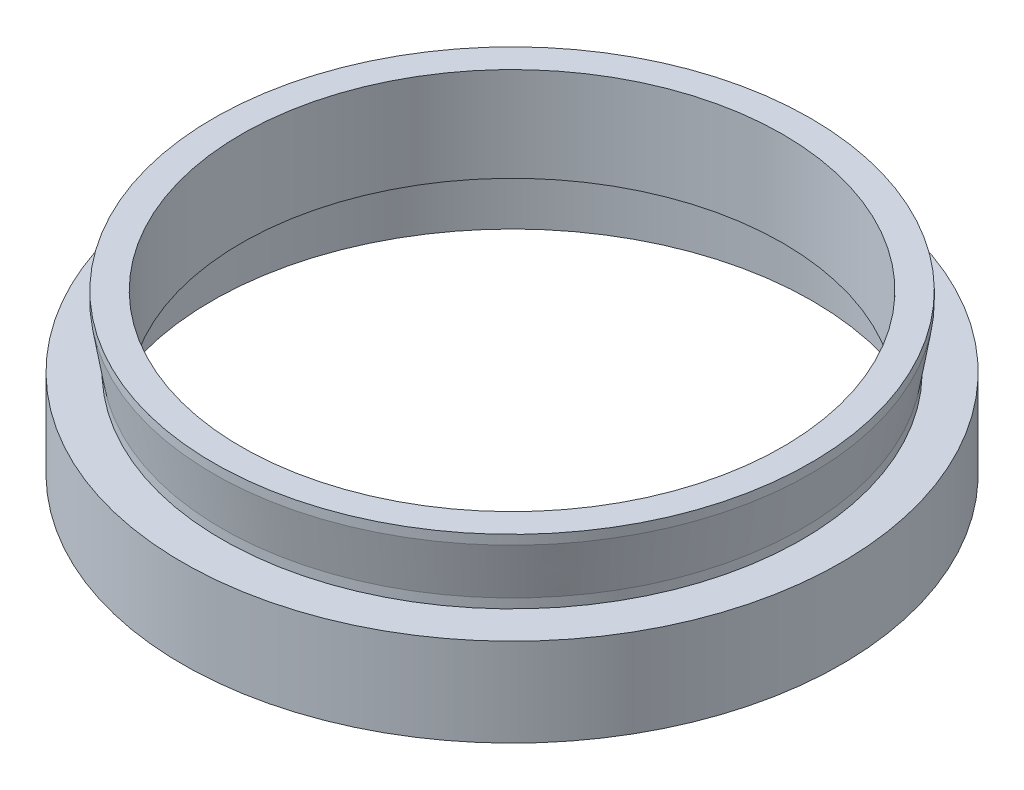
ISO-10303-21;
HEADER;
FILE_DESCRIPTION(('STEP AP214'),'2;1');
FILE_NAME('part.step','',(''),(''),'','','');
FILE_SCHEMA(('AUTOMOTIVE_DESIGN { 1 0 10303 214 1 1 1 1 }'));
ENDSEC;
DATA;
#1=APPLICATION_CONTEXT('core data for automotive mechanical design processes');
#2=APPLICATION_PROTOCOL_DEFINITION('international standard','automotive_design',2000,#1);
#3=PRODUCT_CONTEXT('',#1,'mechanical');
#4=PRODUCT('Part','Part','',(#3));
#5=PRODUCT_RELATED_PRODUCT_CATEGORY('part','',(#4));
#6=PRODUCT_DEFINITION_FORMATION('','',#4);
#7=PRODUCT_DEFINITION_CONTEXT('part definition',#1,'design');
#8=PRODUCT_DEFINITION('design','',#6,#7);
#9=PRODUCT_DEFINITION_SHAPE('','',#8);
#10=(LENGTH_UNIT() NAMED_UNIT(*) SI_UNIT(.MILLI.,.METRE.));
#11=(NAMED_UNIT(*) PLANE_ANGLE_UNIT() SI_UNIT($,.RADIAN.));
#12=(NAMED_UNIT(*) SI_UNIT($,.STERADIAN.) SOLID_ANGLE_UNIT());
#13=UNCERTAINTY_MEASURE_WITH_UNIT(LENGTH_MEASURE(1.E-05),#10,'distance_accuracy_value','');
#14=(GEOMETRIC_REPRESENTATION_CONTEXT(3) GLOBAL_UNCERTAINTY_ASSIGNED_CONTEXT((#13)) GLOBAL_UNIT_ASSIGNED_CONTEXT((#10,
#11,#12)) REPRESENTATION_CONTEXT('',''));
#15=CARTESIAN_POINT('',(0.,0.,0.));
#16=DIRECTION('',(0.,0.,1.));
#17=DIRECTION('',(1.,0.,0.));
#18=AXIS2_PLACEMENT_3D('',#15,#16,#17);
#19=CARTESIAN_POINT('',(-23.,13.,0.));
#20=DIRECTION('',(0.,-1.,0.));
#21=DIRECTION('',(0.,0.,-1.));
#22=AXIS2_PLACEMENT_3D('',#19,#20,#21);
#23=PLANE('',#22);
#24=CARTESIAN_POINT('',(0.,13.,0.));
#25=DIRECTION('',(0.,-1.,0.));
#26=DIRECTION('',(0.,0.,-1.));
#27=AXIS2_PLACEMENT_3D('',#24,#25,#26);
#28=CIRCLE('',#27,25.365);
#29=CARTESIAN_POINT('',(0.,13.,-25.365));
#30=VERTEX_POINT('',#29);
#31=EDGE_CURVE('E10',#30,#30,#28,.T.);
#32=ORIENTED_EDGE('',*,*,#31,.F.);
#33=EDGE_LOOP('',(#32));
#34=FACE_BOUND('',#33,.T.);
#35=CARTESIAN_POINT('',(0.,13.,0.));
#36=DIRECTION('',(0.,-1.,0.));
#37=DIRECTION('',(0.,0.,-1.));
#38=AXIS2_PLACEMENT_3D('',#35,#36,#37);
#39=CIRCLE('',#38,23.);
#40=CARTESIAN_POINT('',(0.,13.,-23.));
#41=VERTEX_POINT('',#40);
#42=EDGE_CURVE('E75',#41,#41,#39,.T.);
#43=ORIENTED_EDGE('',*,*,#42,.T.);
#44=EDGE_LOOP('',(#43));
#45=FACE_BOUND('',#44,.T.);
#46=ADVANCED_FACE('F35',(#34,#45),#23,.F.);
#47=CARTESIAN_POINT('',(0.,0.,0.));
#48=DIRECTION('',(0.,-1.,0.));
#49=DIRECTION('',(0.,0.,-1.));
#50=AXIS2_PLACEMENT_3D('',#47,#48,#49);
#51=CYLINDRICAL_SURFACE('',#50,25.365);
#52=CARTESIAN_POINT('',(0.,12.2,0.));
#53=DIRECTION('',(0.,-1.,0.));
#54=DIRECTION('',(0.,0.,-1.));
#55=AXIS2_PLACEMENT_3D('',#52,#53,#54);
#56=CIRCLE('',#55,25.365);
#57=CARTESIAN_POINT('',(0.,12.2,-25.365));
#58=VERTEX_POINT('',#57);
#59=EDGE_CURVE('E41',#58,#58,#56,.T.);
#60=ORIENTED_EDGE('',*,*,#59,.F.);
#61=EDGE_LOOP('',(#60));
#62=FACE_BOUND('',#61,.T.);
#63=ORIENTED_EDGE('',*,*,#31,.T.);
#64=EDGE_LOOP('',(#63));
#65=FACE_BOUND('',#64,.T.);
#66=ADVANCED_FACE('F136',(#62,#65),#51,.T.);
#67=CARTESIAN_POINT('',(0.,12.2,0.));
#68=DIRECTION('',(0.,1.,0.));
#69=DIRECTION('',(0.,0.,1.));
#70=AXIS2_PLACEMENT_3D('',#67,#68,#69);
#71=CONICAL_SURFACE('',#70,25.365,0.164411486247027);
#72=CARTESIAN_POINT('',(0.,7.8,0.));
#73=DIRECTION('',(0.,-1.,0.));
#74=DIRECTION('',(0.,0.,-1.));
#75=AXIS2_PLACEMENT_3D('',#72,#73,#74);
#76=CIRCLE('',#75,24.635);
#77=CARTESIAN_POINT('',(0.,7.8,-24.635));
#78=VERTEX_POINT('',#77);
#79=EDGE_CURVE('E45',#78,#78,#76,.T.);
#80=ORIENTED_EDGE('',*,*,#79,.F.);
#81=EDGE_LOOP('',(#80));
#82=FACE_BOUND('',#81,.T.);
#83=ORIENTED_EDGE('',*,*,#59,.T.);
#84=EDGE_LOOP('',(#83));
#85=FACE_BOUND('',#84,.T.);
#86=ADVANCED_FACE('F131',(#82,#85),#71,.T.);
#87=CARTESIAN_POINT('',(0.,0.,0.));
#88=DIRECTION('',(0.,-1.,0.));
#89=DIRECTION('',(0.,0.,-1.));
#90=AXIS2_PLACEMENT_3D('',#87,#88,#89);
#91=CYLINDRICAL_SURFACE('',#90,24.635);
#92=CARTESIAN_POINT('',(0.,7.,0.));
#93=DIRECTION('',(0.,-1.,0.));
#94=DIRECTION('',(0.,0.,-1.));
#95=AXIS2_PLACEMENT_3D('',#92,#93,#94);
#96=CIRCLE('',#95,24.635);
#97=CARTESIAN_POINT('',(0.,7.,-24.635));
#98=VERTEX_POINT('',#97);
#99=EDGE_CURVE('E49',#98,#98,#96,.T.);
#100=ORIENTED_EDGE('',*,*,#99,.F.);
#101=EDGE_LOOP('',(#100));
#102=FACE_BOUND('',#101,.T.);
#103=ORIENTED_EDGE('',*,*,#79,.T.);
#104=EDGE_LOOP('',(#103));
#105=FACE_BOUND('',#104,.T.);
#106=ADVANCED_FACE('F125',(#102,#105),#91,.T.);
#107=CARTESIAN_POINT('',(-24.635,7.,0.));
#108=DIRECTION('',(0.,-1.,0.));
#109=DIRECTION('',(0.,0.,-1.));
#110=AXIS2_PLACEMENT_3D('',#107,#108,#109);
#111=PLANE('',#110);
#112=CARTESIAN_POINT('',(0.,7.,0.));
#113=DIRECTION('',(0.,-1.,0.));
#114=DIRECTION('',(0.,0.,-1.));
#115=AXIS2_PLACEMENT_3D('',#112,#113,#114);
#116=CIRCLE('',#115,28.);
#117=CARTESIAN_POINT('',(0.,7.,-28.));
#118=VERTEX_POINT('',#117);
#119=EDGE_CURVE('E54',#118,#118,#116,.T.);
#120=ORIENTED_EDGE('',*,*,#119,.F.);
#121=EDGE_LOOP('',(#120));
#122=FACE_BOUND('',#121,.T.);
#123=ORIENTED_EDGE('',*,*,#99,.T.);
#124=EDGE_LOOP('',(#123));
#125=FACE_BOUND('',#124,.T.);
#126=ADVANCED_FACE('F119',(#122,#125),#111,.F.);
#127=CARTESIAN_POINT('',(0.,0.,0.));
#128=DIRECTION('',(0.,-1.,0.));
#129=DIRECTION('',(0.,0.,-1.));
#130=AXIS2_PLACEMENT_3D('',#127,#128,#129);
#131=CYLINDRICAL_SURFACE('',#130,28.);
#132=CARTESIAN_POINT('',(0.,-0.500000000000002,0.));
#133=DIRECTION('',(0.,-1.,0.));
#134=DIRECTION('',(0.,0.,-1.));
#135=AXIS2_PLACEMENT_3D('',#132,#133,#134);
#136=CIRCLE('',#135,28.);
#137=CARTESIAN_POINT('',(0.,-0.500000000000002,-28.));
#138=VERTEX_POINT('',#137);
#139=EDGE_CURVE('E57',#138,#138,#136,.T.);
#140=ORIENTED_EDGE('',*,*,#139,.F.);
#141=EDGE_LOOP('',(#140));
#142=FACE_BOUND('',#141,.T.);
#143=ORIENTED_EDGE('',*,*,#119,.T.);
#144=EDGE_LOOP('',(#143));
#145=FACE_BOUND('',#144,.T.);
#146=ADVANCED_FACE('F113',(#142,#145),#131,.T.);
#147=CARTESIAN_POINT('',(-28.,-0.500000000000002,0.));
#148=DIRECTION('',(0.,1.,0.));
#149=DIRECTION('',(0.,0.,1.));
#150=AXIS2_PLACEMENT_3D('',#147,#148,#149);
#151=PLANE('',#150);
#152=CARTESIAN_POINT('',(0.,-0.500000000000002,0.));
#153=DIRECTION('',(0.,-1.,0.));
#154=DIRECTION('',(0.,0.,-1.));
#155=AXIS2_PLACEMENT_3D('',#152,#153,#154);
#156=CIRCLE('',#155,25.5);
#157=CARTESIAN_POINT('',(0.,-0.500000000000002,-25.5));
#158=VERTEX_POINT('',#157);
#159=EDGE_CURVE('E60',#158,#158,#156,.T.);
#160=ORIENTED_EDGE('',*,*,#159,.F.);
#161=EDGE_LOOP('',(#160));
#162=FACE_BOUND('',#161,.T.);
#163=ORIENTED_EDGE('',*,*,#139,.T.);
#164=EDGE_LOOP('',(#163));
#165=FACE_BOUND('',#164,.T.);
#166=ADVANCED_FACE('F107',(#162,#165),#151,.F.);
#167=CARTESIAN_POINT('',(0.,0.,0.));
#168=DIRECTION('',(0.,-1.,0.));
#169=DIRECTION('',(0.,0.,-1.));
#170=AXIS2_PLACEMENT_3D('',#167,#168,#169);
#171=CYLINDRICAL_SURFACE('',#170,25.5);
#172=CARTESIAN_POINT('',(0.,4.,0.));
#173=DIRECTION('',(0.,-1.,0.));
#174=DIRECTION('',(0.,0.,-1.));
#175=AXIS2_PLACEMENT_3D('',#172,#173,#174);
#176=CIRCLE('',#175,25.5);
#177=CARTESIAN_POINT('',(0.,4.,-25.5));
#178=VERTEX_POINT('',#177);
#179=EDGE_CURVE('E63',#178,#178,#176,.T.);
#180=ORIENTED_EDGE('',*,*,#179,.F.);
#181=EDGE_LOOP('',(#180));
#182=FACE_BOUND('',#181,.T.);
#183=ORIENTED_EDGE('',*,*,#159,.T.);
#184=EDGE_LOOP('',(#183));
#185=FACE_BOUND('',#184,.T.);
#186=ADVANCED_FACE('F101',(#182,#185),#171,.F.);
#187=CARTESIAN_POINT('',(-26.5,4.,0.));
#188=DIRECTION('',(0.,-1.,0.));
#189=DIRECTION('',(0.,0.,-1.));
#190=AXIS2_PLACEMENT_3D('',#187,#188,#189);
#191=PLANE('',#190);
#192=CARTESIAN_POINT('',(0.,4.,0.));
#193=DIRECTION('',(0.,-1.,0.));
#194=DIRECTION('',(0.,0.,-1.));
#195=AXIS2_PLACEMENT_3D('',#192,#193,#194);
#196=CIRCLE('',#195,26.5);
#197=CARTESIAN_POINT('',(0.,4.,-26.5));
#198=VERTEX_POINT('',#197);
#199=EDGE_CURVE('E66',#198,#198,#196,.T.);
#200=ORIENTED_EDGE('',*,*,#199,.F.);
#201=EDGE_LOOP('',(#200));
#202=FACE_BOUND('',#201,.T.);
#203=ORIENTED_EDGE('',*,*,#179,.T.);
#204=EDGE_LOOP('',(#203));
#205=FACE_BOUND('',#204,.T.);
#206=ADVANCED_FACE('F95',(#202,#205),#191,.F.);
#207=CARTESIAN_POINT('',(0.,0.,0.));
#208=DIRECTION('',(0.,-1.,0.));
#209=DIRECTION('',(0.,0.,-1.));
#210=AXIS2_PLACEMENT_3D('',#207,#208,#209);
#211=CYLINDRICAL_SURFACE('',#210,26.5);
#212=CARTESIAN_POINT('',(0.,5.,0.));
#213=DIRECTION('',(0.,-1.,0.));
#214=DIRECTION('',(0.,0.,-1.));
#215=AXIS2_PLACEMENT_3D('',#212,#213,#214);
#216=CIRCLE('',#215,26.5);
#217=CARTESIAN_POINT('',(0.,5.,-26.5));
#218=VERTEX_POINT('',#217);
#219=EDGE_CURVE('E69',#218,#218,#216,.T.);
#220=ORIENTED_EDGE('',*,*,#219,.F.);
#221=EDGE_LOOP('',(#220));
#222=FACE_BOUND('',#221,.T.);
#223=ORIENTED_EDGE('',*,*,#199,.T.);
#224=EDGE_LOOP('',(#223));
#225=FACE_BOUND('',#224,.T.);
#226=ADVANCED_FACE('F89',(#222,#225),#211,.F.);
#227=CARTESIAN_POINT('',(-23.,5.,0.));
#228=DIRECTION('',(0.,1.,0.));
#229=DIRECTION('',(0.,0.,1.));
#230=AXIS2_PLACEMENT_3D('',#227,#228,#229);
#231=PLANE('',#230);
#232=CARTESIAN_POINT('',(0.,5.,0.));
#233=DIRECTION('',(0.,-1.,0.));
#234=DIRECTION('',(0.,0.,-1.));
#235=AXIS2_PLACEMENT_3D('',#232,#233,#234);
#236=CIRCLE('',#235,23.);
#237=CARTESIAN_POINT('',(0.,5.,-23.));
#238=VERTEX_POINT('',#237);
#239=EDGE_CURVE('E72',#238,#238,#236,.T.);
#240=ORIENTED_EDGE('',*,*,#239,.F.);
#241=EDGE_LOOP('',(#240));
#242=FACE_BOUND('',#241,.T.);
#243=ORIENTED_EDGE('',*,*,#219,.T.);
#244=EDGE_LOOP('',(#243));
#245=FACE_BOUND('',#244,.T.);
#246=ADVANCED_FACE('F83',(#242,#245),#231,.F.);
#247=CARTESIAN_POINT('',(0.,0.,0.));
#248=DIRECTION('',(0.,-1.,0.));
#249=DIRECTION('',(0.,0.,-1.));
#250=AXIS2_PLACEMENT_3D('',#247,#248,#249);
#251=CYLINDRICAL_SURFACE('',#250,23.);
#252=ORIENTED_EDGE('',*,*,#42,.F.);
#253=EDGE_LOOP('',(#252));
#254=FACE_BOUND('',#253,.T.);
#255=ORIENTED_EDGE('',*,*,#239,.T.);
#256=EDGE_LOOP('',(#255));
#257=FACE_BOUND('',#256,.T.);
#258=ADVANCED_FACE('F80',(#254,#257),#251,.F.);
#259=CLOSED_SHELL('',(#46,#66,#86,#106,#126,#146,#166,#186,#206,#226,#246,#258));
#260=MANIFOLD_SOLID_BREP('B2',#259);
#261=ADVANCED_BREP_SHAPE_REPRESENTATION('',(#18,#260),#14);
#262=SHAPE_DEFINITION_REPRESENTATION(#9,#261);
ENDSEC;
END-ISO-10303-21;
